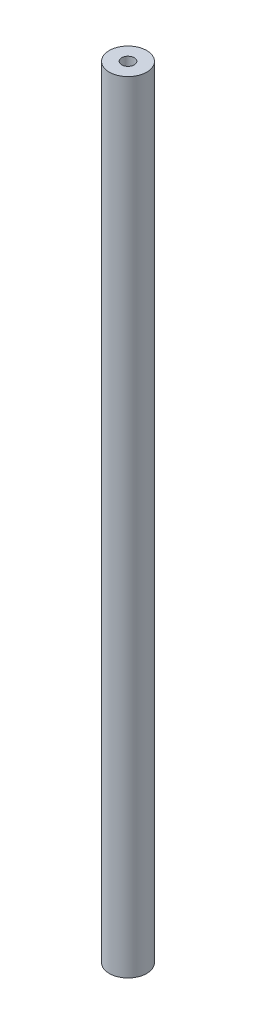
ISO-10303-21;
HEADER;
FILE_DESCRIPTION(('STEP AP214'),'2;1');
FILE_NAME('part.step','',(''),(''),'','','');
FILE_SCHEMA(('AUTOMOTIVE_DESIGN { 1 0 10303 214 1 1 1 1 }'));
ENDSEC;
DATA;
#1=APPLICATION_CONTEXT('core data for automotive mechanical design processes');
#2=APPLICATION_PROTOCOL_DEFINITION('international standard','automotive_design',2000,#1);
#3=PRODUCT_CONTEXT('',#1,'mechanical');
#4=PRODUCT('Part','Part','',(#3));
#5=PRODUCT_RELATED_PRODUCT_CATEGORY('part','',(#4));
#6=PRODUCT_DEFINITION_FORMATION('','',#4);
#7=PRODUCT_DEFINITION_CONTEXT('part definition',#1,'design');
#8=PRODUCT_DEFINITION('design','',#6,#7);
#9=PRODUCT_DEFINITION_SHAPE('','',#8);
#10=(LENGTH_UNIT() NAMED_UNIT(*) SI_UNIT(.MILLI.,.METRE.));
#11=(NAMED_UNIT(*) PLANE_ANGLE_UNIT() SI_UNIT($,.RADIAN.));
#12=(NAMED_UNIT(*) SI_UNIT($,.STERADIAN.) SOLID_ANGLE_UNIT());
#13=UNCERTAINTY_MEASURE_WITH_UNIT(LENGTH_MEASURE(1.E-05),#10,'distance_accuracy_value','');
#14=(GEOMETRIC_REPRESENTATION_CONTEXT(3) GLOBAL_UNCERTAINTY_ASSIGNED_CONTEXT((#13)) GLOBAL_UNIT_ASSIGNED_CONTEXT((#10,
#11,#12)) REPRESENTATION_CONTEXT('',''));
#15=CARTESIAN_POINT('',(0.,0.,0.));
#16=DIRECTION('',(0.,0.,1.));
#17=DIRECTION('',(1.,0.,0.));
#18=AXIS2_PLACEMENT_3D('',#15,#16,#17);
#19=CARTESIAN_POINT('',(0.,125.,0.));
#20=DIRECTION('',(0.,1.,0.));
#21=DIRECTION('',(0.,0.,1.));
#22=AXIS2_PLACEMENT_3D('',#19,#20,#21);
#23=PLANE('',#22);
#24=CARTESIAN_POINT('',(0.,125.,0.));
#25=DIRECTION('',(0.,1.,0.));
#26=DIRECTION('',(0.,0.,1.));
#27=AXIS2_PLACEMENT_3D('',#24,#25,#26);
#28=CIRCLE('',#27,3.);
#29=CARTESIAN_POINT('',(0.,125.,3.));
#30=VERTEX_POINT('',#29);
#31=EDGE_CURVE('E10',#30,#30,#28,.T.);
#32=ORIENTED_EDGE('',*,*,#31,.T.);
#33=EDGE_LOOP('',(#32));
#34=FACE_BOUND('',#33,.T.);
#35=CARTESIAN_POINT('',(0.,125.,0.));
#36=DIRECTION('',(0.,1.,0.));
#37=DIRECTION('',(0.,0.,1.));
#38=AXIS2_PLACEMENT_3D('',#35,#36,#37);
#39=CIRCLE('',#38,1.00000000002066);
#40=CARTESIAN_POINT('',(0.,125.,1.00000000002066));
#41=VERTEX_POINT('',#40);
#42=EDGE_CURVE('E50',#41,#41,#39,.T.);
#43=ORIENTED_EDGE('',*,*,#42,.F.);
#44=EDGE_LOOP('',(#43));
#45=FACE_BOUND('',#44,.T.);
#46=ADVANCED_FACE('F39',(#34,#45),#23,.T.);
#47=CARTESIAN_POINT('',(0.,0.,0.));
#48=DIRECTION('',(0.,1.,0.));
#49=DIRECTION('',(0.,0.,1.));
#50=AXIS2_PLACEMENT_3D('',#47,#48,#49);
#51=PLANE('',#50);
#52=CARTESIAN_POINT('',(0.,0.,0.));
#53=DIRECTION('',(0.,1.,0.));
#54=DIRECTION('',(0.,0.,1.));
#55=AXIS2_PLACEMENT_3D('',#52,#53,#54);
#56=CIRCLE('',#55,3.);
#57=CARTESIAN_POINT('',(0.,0.,3.));
#58=VERTEX_POINT('',#57);
#59=EDGE_CURVE('E43',#58,#58,#56,.T.);
#60=ORIENTED_EDGE('',*,*,#59,.F.);
#61=EDGE_LOOP('',(#60));
#62=FACE_BOUND('',#61,.T.);
#63=CARTESIAN_POINT('',(0.,0.,0.));
#64=DIRECTION('',(0.,1.,0.));
#65=DIRECTION('',(0.,0.,1.));
#66=AXIS2_PLACEMENT_3D('',#63,#64,#65);
#67=CIRCLE('',#66,1.00000000002066);
#68=CARTESIAN_POINT('',(0.,0.,1.00000000002066));
#69=VERTEX_POINT('',#68);
#70=EDGE_CURVE('E52',#69,#69,#67,.T.);
#71=ORIENTED_EDGE('',*,*,#70,.T.);
#72=EDGE_LOOP('',(#71));
#73=FACE_BOUND('',#72,.T.);
#74=ADVANCED_FACE('F62',(#62,#73),#51,.F.);
#75=CARTESIAN_POINT('',(0.,125.,0.));
#76=DIRECTION('',(0.,-1.,0.));
#77=DIRECTION('',(0.,0.,-1.));
#78=AXIS2_PLACEMENT_3D('',#75,#76,#77);
#79=CYLINDRICAL_SURFACE('',#78,3.);
#80=ORIENTED_EDGE('',*,*,#31,.F.);
#81=EDGE_LOOP('',(#80));
#82=FACE_BOUND('',#81,.T.);
#83=ORIENTED_EDGE('',*,*,#59,.T.);
#84=EDGE_LOOP('',(#83));
#85=FACE_BOUND('',#84,.T.);
#86=ADVANCED_FACE('F41',(#82,#85),#79,.T.);
#87=CARTESIAN_POINT('',(0.,125.,0.));
#88=DIRECTION('',(0.,-1.,0.));
#89=DIRECTION('',(0.,0.,-1.));
#90=AXIS2_PLACEMENT_3D('',#87,#88,#89);
#91=CYLINDRICAL_SURFACE('',#90,1.00000000002066);
#92=ORIENTED_EDGE('',*,*,#42,.T.);
#93=EDGE_LOOP('',(#92));
#94=FACE_BOUND('',#93,.T.);
#95=ORIENTED_EDGE('',*,*,#70,.F.);
#96=EDGE_LOOP('',(#95));
#97=FACE_BOUND('',#96,.T.);
#98=ADVANCED_FACE('F58',(#94,#97),#91,.F.);
#99=CLOSED_SHELL('',(#46,#74,#86,#98));
#100=MANIFOLD_SOLID_BREP('B2',#99);
#101=ADVANCED_BREP_SHAPE_REPRESENTATION('',(#18,#100),#14);
#102=SHAPE_DEFINITION_REPRESENTATION(#9,#101);
ENDSEC;
END-ISO-10303-21;
